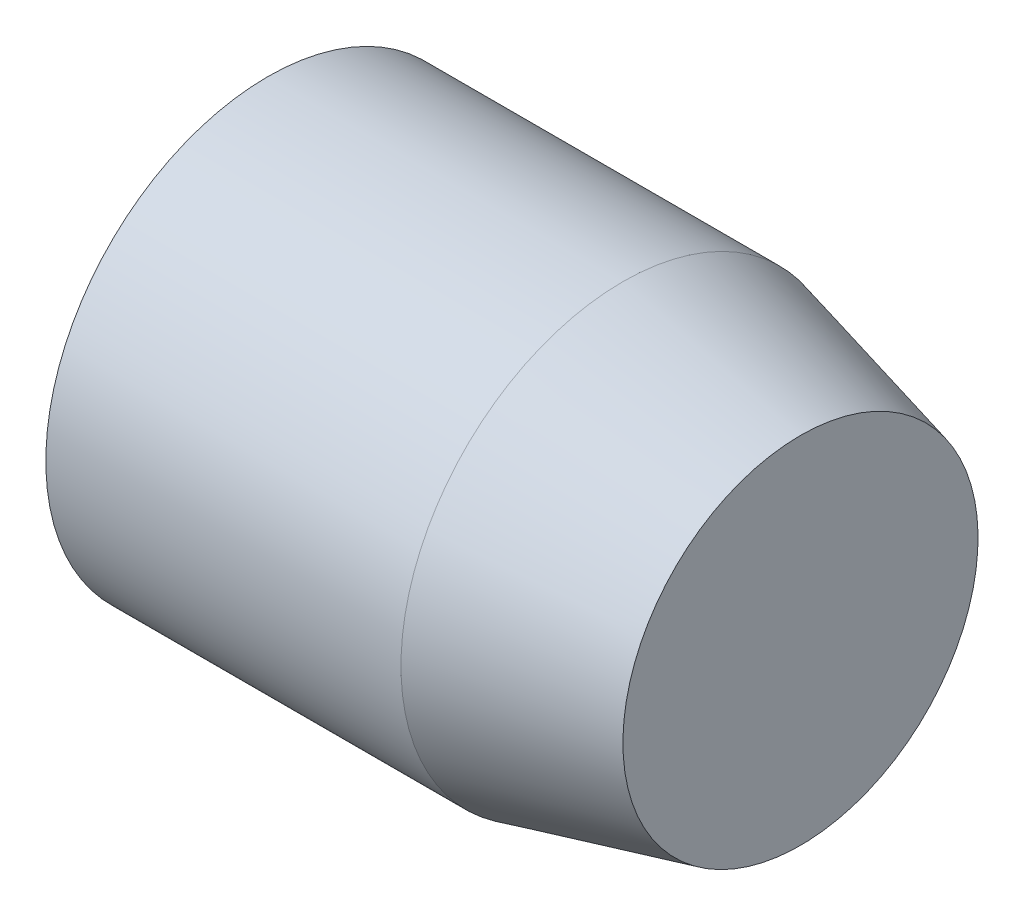
ISO-10303-21;
HEADER;
FILE_DESCRIPTION(('STEP AP214'),'2;1');
FILE_NAME('part.step','',(''),(''),'','','');
FILE_SCHEMA(('AUTOMOTIVE_DESIGN { 1 0 10303 214 1 1 1 1 }'));
ENDSEC;
DATA;
#1=APPLICATION_CONTEXT('core data for automotive mechanical design processes');
#2=APPLICATION_PROTOCOL_DEFINITION('international standard','automotive_design',2000,#1);
#3=PRODUCT_CONTEXT('',#1,'mechanical');
#4=PRODUCT('Part','Part','',(#3));
#5=PRODUCT_RELATED_PRODUCT_CATEGORY('part','',(#4));
#6=PRODUCT_DEFINITION_FORMATION('','',#4);
#7=PRODUCT_DEFINITION_CONTEXT('part definition',#1,'design');
#8=PRODUCT_DEFINITION('design','',#6,#7);
#9=PRODUCT_DEFINITION_SHAPE('','',#8);
#10=(LENGTH_UNIT() NAMED_UNIT(*) SI_UNIT(.MILLI.,.METRE.));
#11=(NAMED_UNIT(*) PLANE_ANGLE_UNIT() SI_UNIT($,.RADIAN.));
#12=(NAMED_UNIT(*) SI_UNIT($,.STERADIAN.) SOLID_ANGLE_UNIT());
#13=UNCERTAINTY_MEASURE_WITH_UNIT(LENGTH_MEASURE(1.E-05),#10,'distance_accuracy_value','');
#14=(GEOMETRIC_REPRESENTATION_CONTEXT(3) GLOBAL_UNCERTAINTY_ASSIGNED_CONTEXT((#13)) GLOBAL_UNIT_ASSIGNED_CONTEXT((#10,
#11,#12)) REPRESENTATION_CONTEXT('',''));
#15=CARTESIAN_POINT('',(0.,0.,0.));
#16=DIRECTION('',(0.,0.,1.));
#17=DIRECTION('',(1.,0.,0.));
#18=AXIS2_PLACEMENT_3D('',#15,#16,#17);
#19=CARTESIAN_POINT('',(0.,0.,0.));
#20=DIRECTION('',(-1.,0.,0.));
#21=DIRECTION('',(0.,-0.999999999999994,0.));
#22=AXIS2_PLACEMENT_3D('',#19,#20,#21);
#23=PLANE('',#22);
#24=CARTESIAN_POINT('',(0.,0.,0.));
#25=DIRECTION('',(1.,0.,0.));
#26=DIRECTION('',(0.,0.999999999999994,0.));
#27=AXIS2_PLACEMENT_3D('',#24,#25,#26);
#28=CIRCLE('',#27,5.);
#29=CARTESIAN_POINT('',(0.,4.99999999999997,0.));
#30=VERTEX_POINT('',#29);
#31=EDGE_CURVE('E10',#30,#30,#28,.T.);
#32=ORIENTED_EDGE('',*,*,#31,.F.);
#33=EDGE_LOOP('',(#32));
#34=FACE_BOUND('',#33,.T.);
#35=ADVANCED_FACE('F34',(#34),#23,.T.);
#36=CARTESIAN_POINT('',(12.,0.,0.));
#37=DIRECTION('',(1.,0.,0.));
#38=DIRECTION('',(0.,0.999999999999994,0.));
#39=AXIS2_PLACEMENT_3D('',#36,#37,#38);
#40=CYLINDRICAL_SURFACE('',#39,5.);
#41=ORIENTED_EDGE('',*,*,#31,.T.);
#42=EDGE_LOOP('',(#41));
#43=FACE_BOUND('',#42,.T.);
#44=CARTESIAN_POINT('',(8.00000000000001,0.,0.));
#45=DIRECTION('',(1.,0.,0.));
#46=DIRECTION('',(0.,0.999999999999994,0.));
#47=AXIS2_PLACEMENT_3D('',#44,#45,#46);
#48=CIRCLE('',#47,5.);
#49=CARTESIAN_POINT('',(8.00000000000001,4.99999999999997,0.));
#50=VERTEX_POINT('',#49);
#51=EDGE_CURVE('E41',#50,#50,#48,.T.);
#52=ORIENTED_EDGE('',*,*,#51,.F.);
#53=EDGE_LOOP('',(#52));
#54=FACE_BOUND('',#53,.T.);
#55=ADVANCED_FACE('F61',(#43,#54),#40,.T.);
#56=CARTESIAN_POINT('',(12.,0.,0.));
#57=DIRECTION('',(-1.,0.,0.));
#58=DIRECTION('',(0.,-0.999999999999994,0.));
#59=AXIS2_PLACEMENT_3D('',#56,#57,#58);
#60=CONICAL_SURFACE('',#59,4.,0.244978663126864);
#61=ORIENTED_EDGE('',*,*,#51,.T.);
#62=EDGE_LOOP('',(#61));
#63=FACE_BOUND('',#62,.T.);
#64=CARTESIAN_POINT('',(12.,0.,0.));
#65=DIRECTION('',(1.,0.,0.));
#66=DIRECTION('',(0.,0.999999999999994,0.));
#67=AXIS2_PLACEMENT_3D('',#64,#65,#66);
#68=CIRCLE('',#67,4.);
#69=CARTESIAN_POINT('',(12.,3.99999999999998,0.));
#70=VERTEX_POINT('',#69);
#71=EDGE_CURVE('E47',#70,#70,#68,.T.);
#72=ORIENTED_EDGE('',*,*,#71,.F.);
#73=EDGE_LOOP('',(#72));
#74=FACE_BOUND('',#73,.T.);
#75=ADVANCED_FACE('F59',(#63,#74),#60,.T.);
#76=CARTESIAN_POINT('',(12.,4.,0.));
#77=DIRECTION('',(1.,0.,0.));
#78=DIRECTION('',(0.,0.999999999999994,0.));
#79=AXIS2_PLACEMENT_3D('',#76,#77,#78);
#80=PLANE('',#79);
#81=ORIENTED_EDGE('',*,*,#71,.T.);
#82=EDGE_LOOP('',(#81));
#83=FACE_BOUND('',#82,.T.);
#84=ADVANCED_FACE('F57',(#83),#80,.T.);
#85=CLOSED_SHELL('',(#35,#55,#75,#84));
#86=MANIFOLD_SOLID_BREP('B2',#85);
#87=ADVANCED_BREP_SHAPE_REPRESENTATION('',(#18,#86),#14);
#88=SHAPE_DEFINITION_REPRESENTATION(#9,#87);
ENDSEC;
END-ISO-10303-21;
